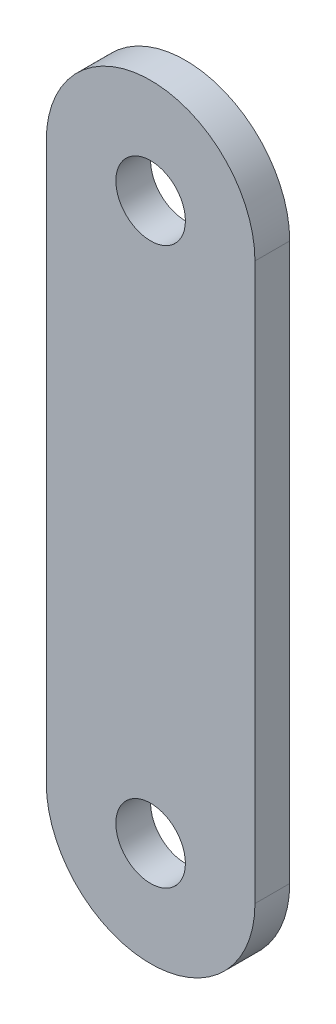
ISO-10303-21;
HEADER;
FILE_DESCRIPTION(('STEP AP214'),'2;1');
FILE_NAME('part.step','',(''),(''),'','','');
FILE_SCHEMA(('AUTOMOTIVE_DESIGN { 1 0 10303 214 1 1 1 1 }'));
ENDSEC;
DATA;
#1=APPLICATION_CONTEXT('core data for automotive mechanical design processes');
#2=APPLICATION_PROTOCOL_DEFINITION('international standard','automotive_design',2000,#1);
#3=PRODUCT_CONTEXT('',#1,'mechanical');
#4=PRODUCT('Part','Part','',(#3));
#5=PRODUCT_RELATED_PRODUCT_CATEGORY('part','',(#4));
#6=PRODUCT_DEFINITION_FORMATION('','',#4);
#7=PRODUCT_DEFINITION_CONTEXT('part definition',#1,'design');
#8=PRODUCT_DEFINITION('design','',#6,#7);
#9=PRODUCT_DEFINITION_SHAPE('','',#8);
#10=(LENGTH_UNIT() NAMED_UNIT(*) SI_UNIT(.MILLI.,.METRE.));
#11=(NAMED_UNIT(*) PLANE_ANGLE_UNIT() SI_UNIT($,.RADIAN.));
#12=(NAMED_UNIT(*) SI_UNIT($,.STERADIAN.) SOLID_ANGLE_UNIT());
#13=UNCERTAINTY_MEASURE_WITH_UNIT(LENGTH_MEASURE(1.E-05),#10,'distance_accuracy_value','');
#14=(GEOMETRIC_REPRESENTATION_CONTEXT(3) GLOBAL_UNCERTAINTY_ASSIGNED_CONTEXT((#13)) GLOBAL_UNIT_ASSIGNED_CONTEXT((#10,
#11,#12)) REPRESENTATION_CONTEXT('',''));
#15=CARTESIAN_POINT('',(0.,0.,0.));
#16=DIRECTION('',(0.,0.,1.));
#17=DIRECTION('',(1.,0.,0.));
#18=AXIS2_PLACEMENT_3D('',#15,#16,#17);
#19=CARTESIAN_POINT('',(-9.52500000000001,0.,1.5875));
#20=DIRECTION('',(1.,0.,0.));
#21=DIRECTION('',(0.,0.,-1.));
#22=AXIS2_PLACEMENT_3D('',#19,#20,#21);
#23=PLANE('',#22);
#24=DIRECTION('',(0.,-1.,0.));
#25=VECTOR('',#24,1.);
#26=CARTESIAN_POINT('',(-9.52500000000001,0.,-1.5875));
#27=LINE('',#26,#25);
#28=CARTESIAN_POINT('',(-9.52500000000001,25.4,-1.5875));
#29=VERTEX_POINT('',#28);
#30=CARTESIAN_POINT('',(-9.52500000000001,-25.4,-1.5875));
#31=VERTEX_POINT('',#30);
#32=EDGE_CURVE('E117',#29,#31,#27,.T.);
#33=ORIENTED_EDGE('',*,*,#32,.T.);
#34=DIRECTION('',(0.,0.,-1.));
#35=VECTOR('',#34,1.);
#36=CARTESIAN_POINT('',(-9.52500000000001,-25.4,1.5875));
#37=LINE('',#36,#35);
#38=CARTESIAN_POINT('',(-9.52500000000001,-25.4,1.5875));
#39=VERTEX_POINT('',#38);
#40=EDGE_CURVE('E11',#39,#31,#37,.T.);
#41=ORIENTED_EDGE('',*,*,#40,.F.);
#42=DIRECTION('',(0.,-1.,0.));
#43=VECTOR('',#42,1.);
#44=CARTESIAN_POINT('',(-9.52500000000001,0.,1.5875));
#45=LINE('',#44,#43);
#46=CARTESIAN_POINT('',(-9.52500000000001,25.4,1.5875));
#47=VERTEX_POINT('',#46);
#48=EDGE_CURVE('E90',#47,#39,#45,.T.);
#49=ORIENTED_EDGE('',*,*,#48,.F.);
#50=DIRECTION('',(0.,0.,-1.));
#51=VECTOR('',#50,1.);
#52=CARTESIAN_POINT('',(-9.52500000000001,25.4,1.5875));
#53=LINE('',#52,#51);
#54=EDGE_CURVE('E105',#47,#29,#53,.T.);
#55=ORIENTED_EDGE('',*,*,#54,.T.);
#56=EDGE_LOOP('',(#33,#41,#49,#55));
#57=FACE_BOUND('',#56,.T.);
#58=ADVANCED_FACE('F41',(#57),#23,.F.);
#59=CARTESIAN_POINT('',(0.,-25.4,1.5875));
#60=DIRECTION('',(0.,0.,-1.));
#61=DIRECTION('',(-1.,0.,0.));
#62=AXIS2_PLACEMENT_3D('',#59,#60,#61);
#63=CYLINDRICAL_SURFACE('',#62,9.52500000000001);
#64=CARTESIAN_POINT('',(0.,-25.4,-1.5875));
#65=DIRECTION('',(0.,0.,1.));
#66=DIRECTION('',(1.,0.,0.));
#67=AXIS2_PLACEMENT_3D('',#64,#65,#66);
#68=CIRCLE('',#67,9.52500000000001);
#69=CARTESIAN_POINT('',(9.52500000000001,-25.4,-1.5875));
#70=VERTEX_POINT('',#69);
#71=EDGE_CURVE('E96',#31,#70,#68,.T.);
#72=ORIENTED_EDGE('',*,*,#71,.T.);
#73=DIRECTION('',(0.,0.,-1.));
#74=VECTOR('',#73,1.);
#75=CARTESIAN_POINT('',(9.52500000000001,-25.4,1.5875));
#76=LINE('',#75,#74);
#77=CARTESIAN_POINT('',(9.52500000000001,-25.4,1.5875));
#78=VERTEX_POINT('',#77);
#79=EDGE_CURVE('E51',#78,#70,#76,.T.);
#80=ORIENTED_EDGE('',*,*,#79,.F.);
#81=CARTESIAN_POINT('',(0.,-25.4,1.5875));
#82=DIRECTION('',(0.,0.,1.));
#83=DIRECTION('',(1.,0.,0.));
#84=AXIS2_PLACEMENT_3D('',#81,#82,#83);
#85=CIRCLE('',#84,9.52500000000001);
#86=EDGE_CURVE('E85',#39,#78,#85,.T.);
#87=ORIENTED_EDGE('',*,*,#86,.F.);
#88=ORIENTED_EDGE('',*,*,#40,.T.);
#89=EDGE_LOOP('',(#72,#80,#87,#88));
#90=FACE_BOUND('',#89,.T.);
#91=ADVANCED_FACE('F95',(#90),#63,.T.);
#92=CARTESIAN_POINT('',(9.52500000000001,0.,1.5875));
#93=DIRECTION('',(1.,0.,0.));
#94=DIRECTION('',(0.,1.,0.));
#95=AXIS2_PLACEMENT_3D('',#92,#93,#94);
#96=PLANE('',#95);
#97=DIRECTION('',(0.,-1.,0.));
#98=VECTOR('',#97,1.);
#99=CARTESIAN_POINT('',(9.52500000000001,0.,-1.5875));
#100=LINE('',#99,#98);
#101=CARTESIAN_POINT('',(9.52500000000001,25.4,-1.5875));
#102=VERTEX_POINT('',#101);
#103=EDGE_CURVE('E123',#102,#70,#100,.T.);
#104=ORIENTED_EDGE('',*,*,#103,.F.);
#105=DIRECTION('',(0.,0.,-1.));
#106=VECTOR('',#105,1.);
#107=CARTESIAN_POINT('',(9.52500000000001,25.4,1.5875));
#108=LINE('',#107,#106);
#109=CARTESIAN_POINT('',(9.52500000000001,25.4,1.5875));
#110=VERTEX_POINT('',#109);
#111=EDGE_CURVE('E75',#110,#102,#108,.T.);
#112=ORIENTED_EDGE('',*,*,#111,.F.);
#113=DIRECTION('',(0.,-1.,0.));
#114=VECTOR('',#113,1.);
#115=CARTESIAN_POINT('',(9.52500000000001,0.,1.5875));
#116=LINE('',#115,#114);
#117=EDGE_CURVE('E88',#110,#78,#116,.T.);
#118=ORIENTED_EDGE('',*,*,#117,.T.);
#119=ORIENTED_EDGE('',*,*,#79,.T.);
#120=EDGE_LOOP('',(#104,#112,#118,#119));
#121=FACE_BOUND('',#120,.T.);
#122=ADVANCED_FACE('F101',(#121),#96,.T.);
#123=CARTESIAN_POINT('',(0.,-25.4,1.5875));
#124=DIRECTION('',(0.,0.,-1.));
#125=DIRECTION('',(-1.,0.,0.));
#126=AXIS2_PLACEMENT_3D('',#123,#124,#125);
#127=CYLINDRICAL_SURFACE('',#126,3.175);
#128=CARTESIAN_POINT('',(0.,-25.4,1.5875));
#129=DIRECTION('',(0.,0.,1.));
#130=DIRECTION('',(1.,0.,0.));
#131=AXIS2_PLACEMENT_3D('',#128,#129,#130);
#132=CIRCLE('',#131,3.175);
#133=CARTESIAN_POINT('',(3.175,-25.4,1.5875));
#134=VERTEX_POINT('',#133);
#135=EDGE_CURVE('E165',#134,#134,#132,.T.);
#136=ORIENTED_EDGE('',*,*,#135,.T.);
#137=EDGE_LOOP('',(#136));
#138=FACE_BOUND('',#137,.T.);
#139=CARTESIAN_POINT('',(0.,-25.4,-1.5875));
#140=DIRECTION('',(0.,0.,1.));
#141=DIRECTION('',(1.,0.,0.));
#142=AXIS2_PLACEMENT_3D('',#139,#140,#141);
#143=CIRCLE('',#142,3.175);
#144=CARTESIAN_POINT('',(3.175,-25.4,-1.5875));
#145=VERTEX_POINT('',#144);
#146=EDGE_CURVE('E113',#145,#145,#143,.T.);
#147=ORIENTED_EDGE('',*,*,#146,.F.);
#148=EDGE_LOOP('',(#147));
#149=FACE_BOUND('',#148,.T.);
#150=ADVANCED_FACE('F154',(#138,#149),#127,.F.);
#151=CARTESIAN_POINT('',(0.,25.4,1.5875));
#152=DIRECTION('',(0.,0.,-1.));
#153=DIRECTION('',(-1.,0.,0.));
#154=AXIS2_PLACEMENT_3D('',#151,#152,#153);
#155=CYLINDRICAL_SURFACE('',#154,3.17499999999999);
#156=CARTESIAN_POINT('',(0.,25.4,1.5875));
#157=DIRECTION('',(0.,0.,1.));
#158=DIRECTION('',(1.,0.,0.));
#159=AXIS2_PLACEMENT_3D('',#156,#157,#158);
#160=CIRCLE('',#159,3.17499999999999);
#161=CARTESIAN_POINT('',(3.17499999999999,25.4,1.5875));
#162=VERTEX_POINT('',#161);
#163=EDGE_CURVE('E128',#162,#162,#160,.T.);
#164=ORIENTED_EDGE('',*,*,#163,.T.);
#165=EDGE_LOOP('',(#164));
#166=FACE_BOUND('',#165,.T.);
#167=CARTESIAN_POINT('',(0.,25.4,-1.5875));
#168=DIRECTION('',(0.,0.,1.));
#169=DIRECTION('',(1.,0.,0.));
#170=AXIS2_PLACEMENT_3D('',#167,#168,#169);
#171=CIRCLE('',#170,3.17499999999999);
#172=CARTESIAN_POINT('',(3.17499999999999,25.4,-1.5875));
#173=VERTEX_POINT('',#172);
#174=EDGE_CURVE('E109',#173,#173,#171,.T.);
#175=ORIENTED_EDGE('',*,*,#174,.F.);
#176=EDGE_LOOP('',(#175));
#177=FACE_BOUND('',#176,.T.);
#178=ADVANCED_FACE('F43',(#166,#177),#155,.F.);
#179=CARTESIAN_POINT('',(0.,25.4,1.5875));
#180=DIRECTION('',(0.,0.,-1.));
#181=DIRECTION('',(-1.,0.,0.));
#182=AXIS2_PLACEMENT_3D('',#179,#180,#181);
#183=CYLINDRICAL_SURFACE('',#182,9.52500000000001);
#184=CARTESIAN_POINT('',(0.,25.4,-1.5875));
#185=DIRECTION('',(0.,0.,1.));
#186=DIRECTION('',(1.,0.,0.));
#187=AXIS2_PLACEMENT_3D('',#184,#185,#186);
#188=CIRCLE('',#187,9.52500000000001);
#189=EDGE_CURVE('E78',#102,#29,#188,.T.);
#190=ORIENTED_EDGE('',*,*,#189,.T.);
#191=ORIENTED_EDGE('',*,*,#54,.F.);
#192=CARTESIAN_POINT('',(0.,25.4,1.5875));
#193=DIRECTION('',(0.,0.,1.));
#194=DIRECTION('',(1.,0.,0.));
#195=AXIS2_PLACEMENT_3D('',#192,#193,#194);
#196=CIRCLE('',#195,9.52500000000001);
#197=EDGE_CURVE('E59',#110,#47,#196,.T.);
#198=ORIENTED_EDGE('',*,*,#197,.F.);
#199=ORIENTED_EDGE('',*,*,#111,.T.);
#200=EDGE_LOOP('',(#190,#191,#198,#199));
#201=FACE_BOUND('',#200,.T.);
#202=ADVANCED_FACE('F142',(#201),#183,.T.);
#203=CARTESIAN_POINT('',(0.,0.,1.5875));
#204=DIRECTION('',(0.,0.,1.));
#205=DIRECTION('',(1.,0.,0.));
#206=AXIS2_PLACEMENT_3D('',#203,#204,#205);
#207=PLANE('',#206);
#208=ORIENTED_EDGE('',*,*,#163,.F.);
#209=EDGE_LOOP('',(#208));
#210=FACE_BOUND('',#209,.T.);
#211=ORIENTED_EDGE('',*,*,#135,.F.);
#212=EDGE_LOOP('',(#211));
#213=FACE_BOUND('',#212,.T.);
#214=ORIENTED_EDGE('',*,*,#48,.T.);
#215=ORIENTED_EDGE('',*,*,#86,.T.);
#216=ORIENTED_EDGE('',*,*,#117,.F.);
#217=ORIENTED_EDGE('',*,*,#197,.T.);
#218=EDGE_LOOP('',(#214,#215,#216,#217));
#219=FACE_BOUND('',#218,.T.);
#220=ADVANCED_FACE('F86',(#210,#213,#219),#207,.T.);
#221=CARTESIAN_POINT('',(0.,0.,-1.5875));
#222=DIRECTION('',(0.,0.,1.));
#223=DIRECTION('',(1.,0.,0.));
#224=AXIS2_PLACEMENT_3D('',#221,#222,#223);
#225=PLANE('',#224);
#226=ORIENTED_EDGE('',*,*,#174,.T.);
#227=EDGE_LOOP('',(#226));
#228=FACE_BOUND('',#227,.T.);
#229=ORIENTED_EDGE('',*,*,#146,.T.);
#230=EDGE_LOOP('',(#229));
#231=FACE_BOUND('',#230,.T.);
#232=ORIENTED_EDGE('',*,*,#32,.F.);
#233=ORIENTED_EDGE('',*,*,#189,.F.);
#234=ORIENTED_EDGE('',*,*,#103,.T.);
#235=ORIENTED_EDGE('',*,*,#71,.F.);
#236=EDGE_LOOP('',(#232,#233,#234,#235));
#237=FACE_BOUND('',#236,.T.);
#238=ADVANCED_FACE('F135',(#228,#231,#237),#225,.F.);
#239=CLOSED_SHELL('',(#58,#91,#122,#150,#178,#202,#220,#238));
#240=MANIFOLD_SOLID_BREP('B2',#239);
#241=ADVANCED_BREP_SHAPE_REPRESENTATION('',(#18,#240),#14);
#242=SHAPE_DEFINITION_REPRESENTATION(#9,#241);
ENDSEC;
END-ISO-10303-21;
